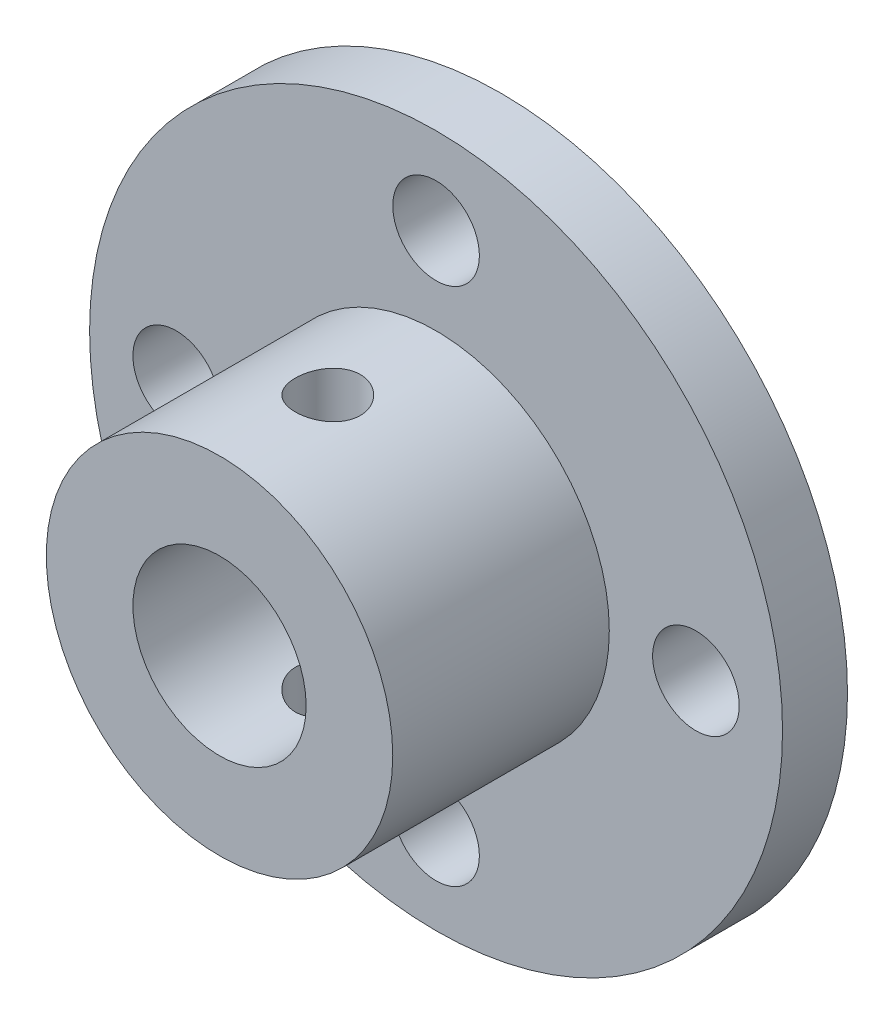
ISO-10303-21;
HEADER;
FILE_DESCRIPTION(('STEP AP214'),'2;1');
FILE_NAME('part.step','',(''),(''),'','','');
FILE_SCHEMA(('AUTOMOTIVE_DESIGN { 1 0 10303 214 1 1 1 1 }'));
ENDSEC;
DATA;
#1=APPLICATION_CONTEXT('core data for automotive mechanical design processes');
#2=APPLICATION_PROTOCOL_DEFINITION('international standard','automotive_design',2000,#1);
#3=PRODUCT_CONTEXT('',#1,'mechanical');
#4=PRODUCT('Part','Part','',(#3));
#5=PRODUCT_RELATED_PRODUCT_CATEGORY('part','',(#4));
#6=PRODUCT_DEFINITION_FORMATION('','',#4);
#7=PRODUCT_DEFINITION_CONTEXT('part definition',#1,'design');
#8=PRODUCT_DEFINITION('design','',#6,#7);
#9=PRODUCT_DEFINITION_SHAPE('','',#8);
#10=(LENGTH_UNIT() NAMED_UNIT(*) SI_UNIT(.MILLI.,.METRE.));
#11=(NAMED_UNIT(*) PLANE_ANGLE_UNIT() SI_UNIT($,.RADIAN.));
#12=(NAMED_UNIT(*) SI_UNIT($,.STERADIAN.) SOLID_ANGLE_UNIT());
#13=UNCERTAINTY_MEASURE_WITH_UNIT(LENGTH_MEASURE(1.E-05),#10,'distance_accuracy_value','');
#14=(GEOMETRIC_REPRESENTATION_CONTEXT(3) GLOBAL_UNCERTAINTY_ASSIGNED_CONTEXT((#13)) GLOBAL_UNIT_ASSIGNED_CONTEXT((#10,
#11,#12)) REPRESENTATION_CONTEXT('',''));
#15=CARTESIAN_POINT('',(0.,0.,0.));
#16=DIRECTION('',(0.,0.,1.));
#17=DIRECTION('',(1.,0.,0.));
#18=AXIS2_PLACEMENT_3D('',#15,#16,#17);
#19=CARTESIAN_POINT('',(0.,0.,3.));
#20=DIRECTION('',(0.,0.,-1.));
#21=DIRECTION('',(-1.,0.,0.));
#22=AXIS2_PLACEMENT_3D('',#19,#20,#21);
#23=CYLINDRICAL_SURFACE('',#22,16.);
#24=CARTESIAN_POINT('',(0.,0.,3.));
#25=DIRECTION('',(0.,0.,1.));
#26=DIRECTION('',(1.,0.,0.));
#27=AXIS2_PLACEMENT_3D('',#24,#25,#26);
#28=CIRCLE('',#27,16.);
#29=CARTESIAN_POINT('',(16.,0.,3.));
#30=VERTEX_POINT('',#29);
#31=EDGE_CURVE('E43',#30,#30,#28,.T.);
#32=ORIENTED_EDGE('',*,*,#31,.F.);
#33=EDGE_LOOP('',(#32));
#34=FACE_BOUND('',#33,.T.);
#35=CARTESIAN_POINT('',(0.,0.,0.));
#36=DIRECTION('',(0.,0.,1.));
#37=DIRECTION('',(1.,0.,0.));
#38=AXIS2_PLACEMENT_3D('',#35,#36,#37);
#39=CIRCLE('',#38,16.);
#40=CARTESIAN_POINT('',(16.,0.,0.));
#41=VERTEX_POINT('',#40);
#42=EDGE_CURVE('E48',#41,#41,#39,.T.);
#43=ORIENTED_EDGE('',*,*,#42,.T.);
#44=EDGE_LOOP('',(#43));
#45=FACE_BOUND('',#44,.T.);
#46=ADVANCED_FACE('F31',(#34,#45),#23,.T.);
#47=CARTESIAN_POINT('',(0.,0.,3.));
#48=DIRECTION('',(0.,0.,1.));
#49=DIRECTION('',(1.,0.,0.));
#50=AXIS2_PLACEMENT_3D('',#47,#48,#49);
#51=PLANE('',#50);
#52=CARTESIAN_POINT('',(12.,0.,3.));
#53=DIRECTION('',(0.,0.,1.));
#54=DIRECTION('',(1.,0.,0.));
#55=AXIS2_PLACEMENT_3D('',#52,#53,#54);
#56=CIRCLE('',#55,2.);
#57=CARTESIAN_POINT('',(14.,0.,3.));
#58=VERTEX_POINT('',#57);
#59=EDGE_CURVE('E211',#58,#58,#56,.T.);
#60=ORIENTED_EDGE('',*,*,#59,.F.);
#61=EDGE_LOOP('',(#60));
#62=FACE_BOUND('',#61,.T.);
#63=CARTESIAN_POINT('',(0.,12.,3.));
#64=DIRECTION('',(0.,0.,1.));
#65=DIRECTION('',(1.,0.,0.));
#66=AXIS2_PLACEMENT_3D('',#63,#64,#65);
#67=CIRCLE('',#66,2.);
#68=CARTESIAN_POINT('',(2.,12.,3.));
#69=VERTEX_POINT('',#68);
#70=EDGE_CURVE('E213',#69,#69,#67,.T.);
#71=ORIENTED_EDGE('',*,*,#70,.F.);
#72=EDGE_LOOP('',(#71));
#73=FACE_BOUND('',#72,.T.);
#74=CARTESIAN_POINT('',(-12.,0.,3.));
#75=DIRECTION('',(0.,0.,1.));
#76=DIRECTION('',(1.,0.,0.));
#77=AXIS2_PLACEMENT_3D('',#74,#75,#76);
#78=CIRCLE('',#77,2.);
#79=CARTESIAN_POINT('',(-10.,0.,3.));
#80=VERTEX_POINT('',#79);
#81=EDGE_CURVE('E216',#80,#80,#78,.T.);
#82=ORIENTED_EDGE('',*,*,#81,.F.);
#83=EDGE_LOOP('',(#82));
#84=FACE_BOUND('',#83,.T.);
#85=CARTESIAN_POINT('',(0.,-12.,3.));
#86=DIRECTION('',(0.,0.,1.));
#87=DIRECTION('',(1.,0.,0.));
#88=AXIS2_PLACEMENT_3D('',#85,#86,#87);
#89=CIRCLE('',#88,2.);
#90=CARTESIAN_POINT('',(2.,-12.,3.));
#91=VERTEX_POINT('',#90);
#92=EDGE_CURVE('E58',#91,#91,#89,.T.);
#93=ORIENTED_EDGE('',*,*,#92,.F.);
#94=EDGE_LOOP('',(#93));
#95=FACE_BOUND('',#94,.T.);
#96=CARTESIAN_POINT('',(0.,0.,3.));
#97=DIRECTION('',(0.,0.,1.));
#98=DIRECTION('',(1.,0.,0.));
#99=AXIS2_PLACEMENT_3D('',#96,#97,#98);
#100=CIRCLE('',#99,8.);
#101=CARTESIAN_POINT('',(8.,0.,3.));
#102=VERTEX_POINT('',#101);
#103=EDGE_CURVE('E10',#102,#102,#100,.T.);
#104=ORIENTED_EDGE('',*,*,#103,.F.);
#105=EDGE_LOOP('',(#104));
#106=FACE_BOUND('',#105,.T.);
#107=ORIENTED_EDGE('',*,*,#31,.T.);
#108=EDGE_LOOP('',(#107));
#109=FACE_BOUND('',#108,.T.);
#110=ADVANCED_FACE('F100',(#62,#73,#84,#95,#106,#109),#51,.T.);
#111=CARTESIAN_POINT('',(0.,0.,0.));
#112=DIRECTION('',(0.,0.,1.));
#113=DIRECTION('',(1.,0.,0.));
#114=AXIS2_PLACEMENT_3D('',#111,#112,#113);
#115=PLANE('',#114);
#116=CARTESIAN_POINT('',(12.,0.,0.));
#117=DIRECTION('',(0.,0.,1.));
#118=DIRECTION('',(1.,0.,0.));
#119=AXIS2_PLACEMENT_3D('',#116,#117,#118);
#120=CIRCLE('',#119,2.);
#121=CARTESIAN_POINT('',(14.,0.,0.));
#122=VERTEX_POINT('',#121);
#123=EDGE_CURVE('E225',#122,#122,#120,.T.);
#124=ORIENTED_EDGE('',*,*,#123,.T.);
#125=EDGE_LOOP('',(#124));
#126=FACE_BOUND('',#125,.T.);
#127=CARTESIAN_POINT('',(0.,12.,0.));
#128=DIRECTION('',(0.,0.,1.));
#129=DIRECTION('',(1.,0.,0.));
#130=AXIS2_PLACEMENT_3D('',#127,#128,#129);
#131=CIRCLE('',#130,2.);
#132=CARTESIAN_POINT('',(2.,12.,0.));
#133=VERTEX_POINT('',#132);
#134=EDGE_CURVE('E226',#133,#133,#131,.T.);
#135=ORIENTED_EDGE('',*,*,#134,.T.);
#136=EDGE_LOOP('',(#135));
#137=FACE_BOUND('',#136,.T.);
#138=CARTESIAN_POINT('',(-12.,0.,0.));
#139=DIRECTION('',(0.,0.,1.));
#140=DIRECTION('',(1.,0.,0.));
#141=AXIS2_PLACEMENT_3D('',#138,#139,#140);
#142=CIRCLE('',#141,2.);
#143=CARTESIAN_POINT('',(-10.,0.,0.));
#144=VERTEX_POINT('',#143);
#145=EDGE_CURVE('E229',#144,#144,#142,.T.);
#146=ORIENTED_EDGE('',*,*,#145,.T.);
#147=EDGE_LOOP('',(#146));
#148=FACE_BOUND('',#147,.T.);
#149=CARTESIAN_POINT('',(0.,-12.,0.));
#150=DIRECTION('',(0.,0.,1.));
#151=DIRECTION('',(1.,0.,0.));
#152=AXIS2_PLACEMENT_3D('',#149,#150,#151);
#153=CIRCLE('',#152,2.);
#154=CARTESIAN_POINT('',(2.,-12.,0.));
#155=VERTEX_POINT('',#154);
#156=EDGE_CURVE('E231',#155,#155,#153,.T.);
#157=ORIENTED_EDGE('',*,*,#156,.T.);
#158=EDGE_LOOP('',(#157));
#159=FACE_BOUND('',#158,.T.);
#160=CARTESIAN_POINT('',(0.,0.,0.));
#161=DIRECTION('',(0.,0.,1.));
#162=DIRECTION('',(1.,0.,0.));
#163=AXIS2_PLACEMENT_3D('',#160,#161,#162);
#164=CIRCLE('',#163,4.);
#165=CARTESIAN_POINT('',(4.,0.,0.));
#166=VERTEX_POINT('',#165);
#167=EDGE_CURVE('E59',#166,#166,#164,.T.);
#168=ORIENTED_EDGE('',*,*,#167,.T.);
#169=EDGE_LOOP('',(#168));
#170=FACE_BOUND('',#169,.T.);
#171=ORIENTED_EDGE('',*,*,#42,.F.);
#172=EDGE_LOOP('',(#171));
#173=FACE_BOUND('',#172,.T.);
#174=ADVANCED_FACE('F98',(#126,#137,#148,#159,#170,#173),#115,.F.);
#175=CARTESIAN_POINT('',(0.,0.,13.));
#176=DIRECTION('',(0.,0.,-1.));
#177=DIRECTION('',(-1.,0.,0.));
#178=AXIS2_PLACEMENT_3D('',#175,#176,#177);
#179=CYLINDRICAL_SURFACE('',#178,8.);
#180=CARTESIAN_POINT('',(0.,-8.,9.5));
#181=CARTESIAN_POINT('',(0.0834717464654709,-7.99999848833852,9.49999681041172));
#182=CARTESIAN_POINT('',(0.166984992730099,-7.99868009921714,9.49300892338062));
#183=CARTESIAN_POINT('',(0.331658129841797,-7.9935478589052,9.46526000488165));
#184=CARTESIAN_POINT('',(0.412815974152225,-7.98973190166897,9.44448734936027));
#185=CARTESIAN_POINT('',(0.570372961851801,-7.98003138765458,9.38982729874066));
#186=CARTESIAN_POINT('',(0.646776330685344,-7.97414869946483,9.35595174754746));
#187=CARTESIAN_POINT('',(0.792807973094007,-7.96095710599783,9.27608112307718));
#188=CARTESIAN_POINT('',(0.862436794477323,-7.9536483161829,9.23008703085518));
#189=CARTESIAN_POINT('',(0.993783715930502,-7.93831336430504,9.12670023199632));
#190=CARTESIAN_POINT('',(1.05540895503183,-7.93028034856351,9.06919055532986));
#191=CARTESIAN_POINT('',(1.16819606135369,-7.9144531845865,8.94465669091244));
#192=CARTESIAN_POINT('',(1.21935717689241,-7.90665905354527,8.87763182023071));
#193=CARTESIAN_POINT('',(1.31014998665793,-7.89212551245005,8.73531391163603));
#194=CARTESIAN_POINT('',(1.34968721969605,-7.88539493886182,8.65995962968276));
#195=CARTESIAN_POINT('',(1.41550524332283,-7.87384713211987,8.50353108482321));
#196=CARTESIAN_POINT('',(1.44178717713098,-7.86902973396962,8.42245731588878));
#197=CARTESIAN_POINT('',(1.480050535035,-7.8619226957455,8.25788476908559));
#198=CARTESIAN_POINT('',(1.49219390192039,-7.85960445366405,8.17442490279654));
#199=CARTESIAN_POINT('',(1.50233808095346,-7.85767197152761,8.00662261519175));
#200=CARTESIAN_POINT('',(1.50034016135374,-7.8580574889876,7.9222802736977));
#201=CARTESIAN_POINT('',(1.48238979602362,-7.86146292701753,7.75628047473396));
#202=CARTESIAN_POINT('',(1.46662149996045,-7.86444808147334,7.67460228569985));
#203=CARTESIAN_POINT('',(1.42186799396207,-7.87266183284666,7.51507158021739));
#204=CARTESIAN_POINT('',(1.39288222239499,-7.87789052509516,7.4372192264907));
#205=CARTESIAN_POINT('',(1.322336471793,-7.89003855292588,7.28701132099974));
#206=CARTESIAN_POINT('',(1.28070213532456,-7.89696783823366,7.21469152941919));
#207=CARTESIAN_POINT('',(1.18609368930416,-7.91172971602918,7.07799527145977));
#208=CARTESIAN_POINT('',(1.13311842889266,-7.91956240015522,7.0136196122852));
#209=CARTESIAN_POINT('',(1.01633905685298,-7.93540001272164,6.89357504432754));
#210=CARTESIAN_POINT('',(0.952377436860683,-7.9434057102403,6.83805934754826));
#211=CARTESIAN_POINT('',(0.815968037098827,-7.95857386108318,6.73852275932459));
#212=CARTESIAN_POINT('',(0.74352017225577,-7.96573630595245,6.69450198312958));
#213=CARTESIAN_POINT('',(0.592034988874669,-7.97842539677509,6.61918224612998));
#214=CARTESIAN_POINT('',(0.512989564446494,-7.98394999136289,6.58789922088211));
#215=CARTESIAN_POINT('',(0.350639115398697,-7.99272505402719,6.53909790690784));
#216=CARTESIAN_POINT('',(0.267334544277787,-7.99597576367994,6.52157815595464));
#217=CARTESIAN_POINT('',(0.100148652903386,-7.99980360641981,6.50101396898173));
#218=CARTESIAN_POINT('',(0.0162940126341359,-8.00041950912279,6.49775960847027));
#219=CARTESIAN_POINT('',(-0.150761248092183,-7.99901543598228,6.50525547954765));
#220=CARTESIAN_POINT('',(-0.233961900480385,-7.99699558964431,6.51600502306526));
#221=CARTESIAN_POINT('',(-0.396681573218217,-7.99057111500406,6.55102903518337));
#222=CARTESIAN_POINT('',(-0.476224261046063,-7.98618522374031,6.57519728253781));
#223=CARTESIAN_POINT('',(-0.630128631824633,-7.97551842212498,6.63625770677879));
#224=CARTESIAN_POINT('',(-0.704489962595103,-7.96923738311334,6.67315074756578));
#225=CARTESIAN_POINT('',(-0.846816671513214,-7.95538030357666,6.75907812815951));
#226=CARTESIAN_POINT('',(-0.914703277015121,-7.94779086174563,6.80824073853684));
#227=CARTESIAN_POINT('',(-1.04133832326455,-7.93219343489712,6.91713813736236));
#228=CARTESIAN_POINT('',(-1.10008590976087,-7.92418541084687,6.97687391300133));
#229=CARTESIAN_POINT('',(-1.20757295872048,-7.9085247569745,7.10617231891143));
#230=CARTESIAN_POINT('',(-1.25616916218577,-7.90087825860257,7.17585490812539));
#231=CARTESIAN_POINT('',(-1.34096675057787,-7.88692985578532,7.32251762452375));
#232=CARTESIAN_POINT('',(-1.37716859613924,-7.8806279013735,7.39949748037047));
#233=CARTESIAN_POINT('',(-1.43594673512823,-7.87013024209574,7.55820586724254));
#234=CARTESIAN_POINT('',(-1.45858868794786,-7.86592440436878,7.63990937955933));
#235=CARTESIAN_POINT('',(-1.48980679326235,-7.86007203802415,7.8060472225214));
#236=CARTESIAN_POINT('',(-1.49838453270708,-7.8584252206579,7.8904812439704));
#237=CARTESIAN_POINT('',(-1.50117762148355,-7.85789199803857,8.05824833144151));
#238=CARTESIAN_POINT('',(-1.49561895003499,-7.85896215974293,8.14157758095699));
#239=CARTESIAN_POINT('',(-1.47079175378803,-7.86364600659998,8.30609142204529));
#240=CARTESIAN_POINT('',(-1.45152331089332,-7.86725967655747,8.38727602642744));
#241=CARTESIAN_POINT('',(-1.39991887583263,-7.8766050802318,8.54507448479548));
#242=CARTESIAN_POINT('',(-1.36760735397252,-7.88233284594965,8.62169659134577));
#243=CARTESIAN_POINT('',(-1.29085868912204,-7.8952638755184,8.76846825424084));
#244=CARTESIAN_POINT('',(-1.24642068948186,-7.90246724360119,8.83861735284478));
#245=CARTESIAN_POINT('',(-1.14589487339535,-7.91767266107745,8.97158368004229));
#246=CARTESIAN_POINT('',(-1.08964259864303,-7.92568505353043,9.0342754125671));
#247=CARTESIAN_POINT('',(-0.96742792674229,-7.94152833918735,9.14940516246452));
#248=CARTESIAN_POINT('',(-0.901463301891616,-7.94935919027328,9.20184082098014));
#249=CARTESIAN_POINT('',(-0.760984945071872,-7.96403975968049,9.29541095262706));
#250=CARTESIAN_POINT('',(-0.686399590640516,-7.97088000990561,9.33643942849064));
#251=CARTESIAN_POINT('',(-0.531290113653833,-7.98271619380687,9.40531763660514));
#252=CARTESIAN_POINT('',(-0.450771651705247,-7.98771385879037,9.43317974704691));
#253=CARTESIAN_POINT('',(-0.308347202825154,-7.99428290707632,9.46927731441867));
#254=CARTESIAN_POINT('',(-0.24727381025187,-7.99641470878206,9.4807786303128));
#255=CARTESIAN_POINT('',(-0.124141247115158,-7.9992737995401,9.49614106211645));
#256=CARTESIAN_POINT('',(-0.0620821016527095,-8.00000112429805,9.50000237225591));
#257=CARTESIAN_POINT('',(0.,-8.,9.5));
#258=B_SPLINE_CURVE_WITH_KNOTS('',3,(#180,#181,#182,#183,#184,#185,#186,#187,#188,#189,#190,
#191,#192,#193,#194,#195,#196,#197,#198,#199,#200,#201,#202,#203,#204,#205,#206,#207,#208,#209,
#210,#211,#212,#213,#214,#215,#216,#217,#218,#219,#220,#221,#222,#223,#224,#225,#226,#227,#228,
#229,#230,#231,#232,#233,#234,#235,#236,#237,#238,#239,#240,#241,#242,#243,#244,#245,#246,#247,
#248,#249,#250,#251,#252,#253,#254,#255,#256,#257),.UNSPECIFIED.,.T.,.F.,(4,2,2,2,2,2,2,2,2,2,2,
2,2,2,2,2,2,2,2,2,2,2,2,2,2,2,2,2,2,2,2,2,2,2,2,2,2,2,4),(0.,0.250188200964924,
0.500587642535452,0.750761271230907,1.00091465336891,1.2537511801363,1.50660586283617,
1.76146190504357,2.01629596311948,2.26818151445336,2.52004447587256,2.76859000612765,
3.01714609846786,3.2671926262953,3.51726454049859,3.77127768464077,4.02529337544948,
4.27962588321699,4.53393136673745,4.78448174076097,5.03501980464583,5.28360233907828,
5.53220175338032,5.78351778017708,6.03485728413098,6.28953436987299,6.54420198954945,
6.79762627818559,7.05102196946512,7.30039252231748,7.54976158541506,7.79866496207692,
8.04758592655423,8.3002336996638,8.55293951262255,8.80792048916315,9.06266126931173,
9.24874344524409,9.43482089039541),.UNSPECIFIED.);
#259=CARTESIAN_POINT('',(0.,-8.,9.5));
#260=VERTEX_POINT('',#259);
#261=EDGE_CURVE('E88',#260,#260,#258,.T.);
#262=ORIENTED_EDGE('',*,*,#261,.T.);
#263=EDGE_LOOP('',(#262));
#264=FACE_BOUND('',#263,.T.);
#265=CARTESIAN_POINT('',(0.,8.,9.5));
#266=CARTESIAN_POINT('',(-0.0834717464654709,7.99999848833852,9.49999681041172));
#267=CARTESIAN_POINT('',(-0.166984992730099,7.99868009921714,9.49300892338062));
#268=CARTESIAN_POINT('',(-0.331658129841797,7.9935478589052,9.46526000488165));
#269=CARTESIAN_POINT('',(-0.412815974152225,7.98973190166897,9.44448734936027));
#270=CARTESIAN_POINT('',(-0.570372961851801,7.98003138765458,9.38982729874066));
#271=CARTESIAN_POINT('',(-0.646776330685344,7.97414869946483,9.35595174754746));
#272=CARTESIAN_POINT('',(-0.792807973094007,7.96095710599783,9.27608112307718));
#273=CARTESIAN_POINT('',(-0.862436794477323,7.9536483161829,9.23008703085518));
#274=CARTESIAN_POINT('',(-0.993783715930502,7.93831336430504,9.12670023199632));
#275=CARTESIAN_POINT('',(-1.05540895503183,7.93028034856351,9.06919055532986));
#276=CARTESIAN_POINT('',(-1.16819606135369,7.9144531845865,8.94465669091244));
#277=CARTESIAN_POINT('',(-1.21935717689241,7.90665905354527,8.87763182023071));
#278=CARTESIAN_POINT('',(-1.31014998665793,7.89212551245005,8.73531391163603));
#279=CARTESIAN_POINT('',(-1.34968721969605,7.88539493886182,8.65995962968276));
#280=CARTESIAN_POINT('',(-1.41550524332283,7.87384713211987,8.50353108482321));
#281=CARTESIAN_POINT('',(-1.44178717713098,7.86902973396962,8.42245731588878));
#282=CARTESIAN_POINT('',(-1.480050535035,7.8619226957455,8.25788476908559));
#283=CARTESIAN_POINT('',(-1.49219390192039,7.85960445366405,8.17442490279654));
#284=CARTESIAN_POINT('',(-1.50233808095346,7.85767197152761,8.00662261519175));
#285=CARTESIAN_POINT('',(-1.50034016135374,7.8580574889876,7.9222802736977));
#286=CARTESIAN_POINT('',(-1.48238979602362,7.86146292701753,7.75628047473396));
#287=CARTESIAN_POINT('',(-1.46662149996045,7.86444808147334,7.67460228569985));
#288=CARTESIAN_POINT('',(-1.42186799396207,7.87266183284666,7.51507158021739));
#289=CARTESIAN_POINT('',(-1.39288222239499,7.87789052509516,7.4372192264907));
#290=CARTESIAN_POINT('',(-1.322336471793,7.89003855292588,7.28701132099974));
#291=CARTESIAN_POINT('',(-1.28070213532456,7.89696783823366,7.21469152941919));
#292=CARTESIAN_POINT('',(-1.18609368930416,7.91172971602918,7.07799527145977));
#293=CARTESIAN_POINT('',(-1.13311842889266,7.91956240015522,7.0136196122852));
#294=CARTESIAN_POINT('',(-1.01633905685298,7.93540001272164,6.89357504432754));
#295=CARTESIAN_POINT('',(-0.952377436860683,7.9434057102403,6.83805934754826));
#296=CARTESIAN_POINT('',(-0.815968037098827,7.95857386108318,6.73852275932459));
#297=CARTESIAN_POINT('',(-0.74352017225577,7.96573630595245,6.69450198312958));
#298=CARTESIAN_POINT('',(-0.592034988874669,7.97842539677509,6.61918224612998));
#299=CARTESIAN_POINT('',(-0.512989564446494,7.98394999136289,6.58789922088211));
#300=CARTESIAN_POINT('',(-0.350639115398697,7.99272505402719,6.53909790690784));
#301=CARTESIAN_POINT('',(-0.267334544277787,7.99597576367994,6.52157815595464));
#302=CARTESIAN_POINT('',(-0.100148652903386,7.99980360641981,6.50101396898173));
#303=CARTESIAN_POINT('',(-0.0162940126341359,8.00041950912279,6.49775960847027));
#304=CARTESIAN_POINT('',(0.150761248092183,7.99901543598228,6.50525547954765));
#305=CARTESIAN_POINT('',(0.233961900480385,7.99699558964431,6.51600502306526));
#306=CARTESIAN_POINT('',(0.396681573218217,7.99057111500406,6.55102903518337));
#307=CARTESIAN_POINT('',(0.476224261046063,7.98618522374031,6.57519728253781));
#308=CARTESIAN_POINT('',(0.630128631824633,7.97551842212498,6.63625770677879));
#309=CARTESIAN_POINT('',(0.704489962595103,7.96923738311334,6.67315074756578));
#310=CARTESIAN_POINT('',(0.846816671513214,7.95538030357666,6.75907812815951));
#311=CARTESIAN_POINT('',(0.914703277015121,7.94779086174563,6.80824073853684));
#312=CARTESIAN_POINT('',(1.04133832326455,7.93219343489712,6.91713813736236));
#313=CARTESIAN_POINT('',(1.10008590976087,7.92418541084687,6.97687391300133));
#314=CARTESIAN_POINT('',(1.20757295872048,7.9085247569745,7.10617231891143));
#315=CARTESIAN_POINT('',(1.25616916218577,7.90087825860257,7.17585490812539));
#316=CARTESIAN_POINT('',(1.34096675057787,7.88692985578532,7.32251762452375));
#317=CARTESIAN_POINT('',(1.37716859613924,7.8806279013735,7.39949748037047));
#318=CARTESIAN_POINT('',(1.43594673512823,7.87013024209574,7.55820586724254));
#319=CARTESIAN_POINT('',(1.45858868794786,7.86592440436878,7.63990937955933));
#320=CARTESIAN_POINT('',(1.48980679326235,7.86007203802415,7.8060472225214));
#321=CARTESIAN_POINT('',(1.49838453270708,7.8584252206579,7.8904812439704));
#322=CARTESIAN_POINT('',(1.50117762148355,7.85789199803857,8.05824833144151));
#323=CARTESIAN_POINT('',(1.49561895003499,7.85896215974293,8.14157758095699));
#324=CARTESIAN_POINT('',(1.47079175378803,7.86364600659998,8.30609142204529));
#325=CARTESIAN_POINT('',(1.45152331089332,7.86725967655747,8.38727602642744));
#326=CARTESIAN_POINT('',(1.39991887583263,7.8766050802318,8.54507448479548));
#327=CARTESIAN_POINT('',(1.36760735397252,7.88233284594965,8.62169659134577));
#328=CARTESIAN_POINT('',(1.29085868912204,7.8952638755184,8.76846825424084));
#329=CARTESIAN_POINT('',(1.24642068948186,7.90246724360119,8.83861735284478));
#330=CARTESIAN_POINT('',(1.14589487339535,7.91767266107745,8.97158368004229));
#331=CARTESIAN_POINT('',(1.08964259864303,7.92568505353043,9.0342754125671));
#332=CARTESIAN_POINT('',(0.96742792674229,7.94152833918735,9.14940516246452));
#333=CARTESIAN_POINT('',(0.901463301891616,7.94935919027328,9.20184082098014));
#334=CARTESIAN_POINT('',(0.760984945071872,7.96403975968049,9.29541095262706));
#335=CARTESIAN_POINT('',(0.686399590640516,7.97088000990561,9.33643942849064));
#336=CARTESIAN_POINT('',(0.531290113653833,7.98271619380687,9.40531763660514));
#337=CARTESIAN_POINT('',(0.450771651705247,7.98771385879037,9.43317974704691));
#338=CARTESIAN_POINT('',(0.308347202825154,7.99428290707632,9.46927731441867));
#339=CARTESIAN_POINT('',(0.24727381025187,7.99641470878206,9.4807786303128));
#340=CARTESIAN_POINT('',(0.124141247115158,7.9992737995401,9.49614106211645));
#341=CARTESIAN_POINT('',(0.0620821016527095,8.00000112429805,9.50000237225591));
#342=CARTESIAN_POINT('',(0.,8.,9.5));
#343=B_SPLINE_CURVE_WITH_KNOTS('',3,(#265,#266,#267,#268,#269,#270,#271,#272,#273,#274,#275,
#276,#277,#278,#279,#280,#281,#282,#283,#284,#285,#286,#287,#288,#289,#290,#291,#292,#293,#294,
#295,#296,#297,#298,#299,#300,#301,#302,#303,#304,#305,#306,#307,#308,#309,#310,#311,#312,#313,
#314,#315,#316,#317,#318,#319,#320,#321,#322,#323,#324,#325,#326,#327,#328,#329,#330,#331,#332,
#333,#334,#335,#336,#337,#338,#339,#340,#341,#342),.UNSPECIFIED.,.T.,.F.,(4,2,2,2,2,2,2,2,2,2,2,
2,2,2,2,2,2,2,2,2,2,2,2,2,2,2,2,2,2,2,2,2,2,2,2,2,2,2,4),(0.,0.250188200964924,
0.500587642535452,0.750761271230907,1.00091465336891,1.2537511801363,1.50660586283617,
1.76146190504357,2.01629596311948,2.26818151445336,2.52004447587256,2.76859000612765,
3.01714609846786,3.2671926262953,3.51726454049859,3.77127768464077,4.02529337544948,
4.27962588321699,4.53393136673745,4.78448174076097,5.03501980464583,5.28360233907828,
5.53220175338032,5.78351778017708,6.03485728413098,6.28953436987299,6.54420198954945,
6.79762627818559,7.05102196946512,7.30039252231748,7.54976158541506,7.79866496207692,
8.04758592655423,8.3002336996638,8.55293951262255,8.80792048916315,9.06266126931173,
9.24874344524409,9.43482089039541),.UNSPECIFIED.);
#344=CARTESIAN_POINT('',(0.,8.,9.5));
#345=VERTEX_POINT('',#344);
#346=EDGE_CURVE('E82',#345,#345,#343,.T.);
#347=ORIENTED_EDGE('',*,*,#346,.T.);
#348=EDGE_LOOP('',(#347));
#349=FACE_BOUND('',#348,.T.);
#350=CARTESIAN_POINT('',(0.,0.,13.));
#351=DIRECTION('',(0.,0.,1.));
#352=DIRECTION('',(1.,0.,0.));
#353=AXIS2_PLACEMENT_3D('',#350,#351,#352);
#354=CIRCLE('',#353,8.);
#355=CARTESIAN_POINT('',(8.,0.,13.));
#356=VERTEX_POINT('',#355);
#357=EDGE_CURVE('E51',#356,#356,#354,.T.);
#358=ORIENTED_EDGE('',*,*,#357,.F.);
#359=EDGE_LOOP('',(#358));
#360=FACE_BOUND('',#359,.T.);
#361=ORIENTED_EDGE('',*,*,#103,.T.);
#362=EDGE_LOOP('',(#361));
#363=FACE_BOUND('',#362,.T.);
#364=ADVANCED_FACE('F93',(#264,#349,#360,#363),#179,.T.);
#365=CARTESIAN_POINT('',(0.,0.,13.));
#366=DIRECTION('',(0.,0.,1.));
#367=DIRECTION('',(1.,0.,0.));
#368=AXIS2_PLACEMENT_3D('',#365,#366,#367);
#369=PLANE('',#368);
#370=CARTESIAN_POINT('',(0.,0.,13.));
#371=DIRECTION('',(0.,0.,1.));
#372=DIRECTION('',(1.,0.,0.));
#373=AXIS2_PLACEMENT_3D('',#370,#371,#372);
#374=CIRCLE('',#373,4.);
#375=CARTESIAN_POINT('',(4.,0.,13.));
#376=VERTEX_POINT('',#375);
#377=EDGE_CURVE('E56',#376,#376,#374,.T.);
#378=ORIENTED_EDGE('',*,*,#377,.F.);
#379=EDGE_LOOP('',(#378));
#380=FACE_BOUND('',#379,.T.);
#381=ORIENTED_EDGE('',*,*,#357,.T.);
#382=EDGE_LOOP('',(#381));
#383=FACE_BOUND('',#382,.T.);
#384=ADVANCED_FACE('F97',(#380,#383),#369,.T.);
#385=CARTESIAN_POINT('',(0.,0.,0.));
#386=DIRECTION('',(0.,0.,1.));
#387=DIRECTION('',(1.,0.,0.));
#388=AXIS2_PLACEMENT_3D('',#385,#386,#387);
#389=CYLINDRICAL_SURFACE('',#388,4.);
#390=CARTESIAN_POINT('',(0.,-4.,9.5));
#391=CARTESIAN_POINT('',(-0.0812350589378527,-4.00000217456151,9.50000290230311));
#392=CARTESIAN_POINT('',(-0.162450241781792,-3.99750379283184,9.49338023975162));
#393=CARTESIAN_POINT('',(-0.322453452352361,-3.98778696006928,9.46717180473007));
#394=CARTESIAN_POINT('',(-0.401241827987616,-3.98056918893993,9.44758789952943));
#395=CARTESIAN_POINT('',(-0.554060784990878,-3.96218832391545,9.39624699822824));
#396=CARTESIAN_POINT('',(-0.628100224162277,-3.9510328434944,9.36451348317821));
#397=CARTESIAN_POINT('',(-0.769799310160253,-3.92588767765353,9.28989358698418));
#398=CARTESIAN_POINT('',(-0.837457239177879,-3.91189723227548,9.24700421445585));
#399=CARTESIAN_POINT('',(-0.967346417045825,-3.88186246971217,9.14938746892909));
#400=CARTESIAN_POINT('',(-1.02927073015119,-3.86576002583566,9.0942697377406));
#401=CARTESIAN_POINT('',(-1.14324421474363,-3.83360220871327,8.97458956534116));
#402=CARTESIAN_POINT('',(-1.19529036359203,-3.81754685135033,8.91002424391213));
#403=CARTESIAN_POINT('',(-1.28998202215985,-3.78662470617731,8.77028253247679));
#404=CARTESIAN_POINT('',(-1.3321939319576,-3.77182648820818,8.69479563345418));
#405=CARTESIAN_POINT('',(-1.40318646334084,-3.74599860237433,8.53715164583148));
#406=CARTESIAN_POINT('',(-1.43197244961239,-3.73496742975881,8.4549972368449));
#407=CARTESIAN_POINT('',(-1.47408431017549,-3.71854412824136,8.2898832597418));
#408=CARTESIAN_POINT('',(-1.48799593218558,-3.71293924350838,8.20709496156456));
#409=CARTESIAN_POINT('',(-1.50179556531648,-3.70738061461215,8.04018384200616));
#410=CARTESIAN_POINT('',(-1.50168936802631,-3.70742453659305,7.95606158612553));
#411=CARTESIAN_POINT('',(-1.48790429610018,-3.71297511632055,7.79423047478705));
#412=CARTESIAN_POINT('',(-1.47503808509004,-3.71815468871122,7.71643909395582));
#413=CARTESIAN_POINT('',(-1.4374416786833,-3.73284938059529,7.56421284959468));
#414=CARTESIAN_POINT('',(-1.41270969663258,-3.74236515298863,7.48977849338612));
#415=CARTESIAN_POINT('',(-1.35163748571904,-3.76485702190253,7.34472293227177));
#416=CARTESIAN_POINT('',(-1.31508648737101,-3.77789517988166,7.2742005138787));
#417=CARTESIAN_POINT('',(-1.23156073762698,-3.80594210139319,7.14005426240903));
#418=CARTESIAN_POINT('',(-1.18458238728897,-3.82095154457158,7.0764328224803));
#419=CARTESIAN_POINT('',(-1.07781780766549,-3.85248038859113,6.95339633634912));
#420=CARTESIAN_POINT('',(-1.01738298716956,-3.86903347455671,6.89455135925191));
#421=CARTESIAN_POINT('',(-0.887312590819021,-3.90091728164085,6.7876620337942));
#422=CARTESIAN_POINT('',(-0.817675603497364,-3.91624781465952,6.73961934539433));
#423=CARTESIAN_POINT('',(-0.66972343699242,-3.9442639480908,6.65506960293748));
#424=CARTESIAN_POINT('',(-0.59129071384472,-3.95690498259616,6.61875241877894));
#425=CARTESIAN_POINT('',(-0.428836850524584,-3.97778718326962,6.56001739572996));
#426=CARTESIAN_POINT('',(-0.344818210845768,-3.98603030341493,6.53759338343888));
#427=CARTESIAN_POINT('',(-0.178375243148666,-3.99684443228065,6.50837721245806));
#428=CARTESIAN_POINT('',(-0.0961036195622098,-3.99969369025686,6.50081739361749));
#429=CARTESIAN_POINT('',(0.0685724752550238,-4.00025893700126,6.49930893610008));
#430=CARTESIAN_POINT('',(0.150976912983372,-3.99797606386863,6.50535727968322));
#431=CARTESIAN_POINT('',(0.310262048561859,-3.98871709772643,6.53031004230867));
#432=CARTESIAN_POINT('',(0.387233328007336,-3.98192470962305,6.54871154373709));
#433=CARTESIAN_POINT('',(0.536941754957221,-3.96451477091717,6.59718607254732));
#434=CARTESIAN_POINT('',(0.609678350347534,-3.9538967228203,6.62726061794803));
#435=CARTESIAN_POINT('',(0.751247765110155,-3.92949624407681,6.69918641243947));
#436=CARTESIAN_POINT('',(0.819903083557795,-3.91563000209348,6.74135772922338));
#437=CARTESIAN_POINT('',(0.949392711726625,-3.88626671564664,6.83591810317156));
#438=CARTESIAN_POINT('',(1.01022412027045,-3.87076907009516,6.88831093254515));
#439=CARTESIAN_POINT('',(1.12603079874454,-3.8387332949099,7.00540412212427));
#440=CARTESIAN_POINT('',(1.18046154123569,-3.82218696503729,7.0706421827727));
#441=CARTESIAN_POINT('',(1.27771050031903,-3.79078815746854,7.20965138470766));
#442=CARTESIAN_POINT('',(1.32052767414518,-3.77593583194399,7.2834232913885));
#443=CARTESIAN_POINT('',(1.39337773518998,-3.74966829822463,7.43801598677231));
#444=CARTESIAN_POINT('',(1.42335685446918,-3.73826760328493,7.51886474591044));
#445=CARTESIAN_POINT('',(1.46907883466889,-3.72054032891005,7.68500976368782));
#446=CARTESIAN_POINT('',(1.48483050305535,-3.71421061057491,7.77030323619812));
#447=CARTESIAN_POINT('',(1.50086347097839,-3.70775894792573,7.93701615954111));
#448=CARTESIAN_POINT('',(1.50207331495837,-3.70726444523341,8.01833263171689));
#449=CARTESIAN_POINT('',(1.49136715641593,-3.71158412745292,8.17994531627617));
#450=CARTESIAN_POINT('',(1.47945239850124,-3.71639780898899,8.26024162467158));
#451=CARTESIAN_POINT('',(1.44355815630242,-3.73048141585432,8.41504722671655));
#452=CARTESIAN_POINT('',(1.41995798316524,-3.73961085376663,8.48965834624535));
#453=CARTESIAN_POINT('',(1.3616969677992,-3.76121548297845,8.63390550849442));
#454=CARTESIAN_POINT('',(1.32703332944945,-3.77369151995215,8.70354028807014));
#455=CARTESIAN_POINT('',(1.24552075938154,-3.80139723903965,8.83982678969763));
#456=CARTESIAN_POINT('',(1.1981283280301,-3.81673698440964,8.90613079679991));
#457=CARTESIAN_POINT('',(1.09334485729906,-3.84806246757177,9.03014156097121));
#458=CARTESIAN_POINT('',(1.03595064012808,-3.86404840943145,9.08784557478675));
#459=CARTESIAN_POINT('',(0.909080396784624,-3.89590424609881,9.19620195582184));
#460=CARTESIAN_POINT('',(0.839118644212993,-3.91172104900645,9.24630375343467));
#461=CARTESIAN_POINT('',(0.691213223200822,-3.94054514457031,9.33402265527655));
#462=CARTESIAN_POINT('',(0.613268934090622,-3.95355221851559,9.37163878773637));
#463=CARTESIAN_POINT('',(0.447999082002313,-3.9757429260668,9.43437682904833));
#464=CARTESIAN_POINT('',(0.36041342223421,-3.98473657158356,9.4588870646019));
#465=CARTESIAN_POINT('',(0.181875733606383,-3.99686242179587,9.49169295992068));
#466=CARTESIAN_POINT('',(0.0909254163648595,-3.99999756603967,9.49999675148732));
#467=CARTESIAN_POINT('',(0.,-4.,9.5));
#468=B_SPLINE_CURVE_WITH_KNOTS('',3,(#390,#391,#392,#393,#394,#395,#396,#397,#398,#399,#400,
#401,#402,#403,#404,#405,#406,#407,#408,#409,#410,#411,#412,#413,#414,#415,#416,#417,#418,#419,
#420,#421,#422,#423,#424,#425,#426,#427,#428,#429,#430,#431,#432,#433,#434,#435,#436,#437,#438,
#439,#440,#441,#442,#443,#444,#445,#446,#447,#448,#449,#450,#451,#452,#453,#454,#455,#456,#457,
#458,#459,#460,#461,#462,#463,#464,#465,#466,#467),.UNSPECIFIED.,.T.,.F.,(4,2,2,2,2,2,2,2,2,2,2,
2,2,2,2,2,2,2,2,2,2,2,2,2,2,2,2,2,2,2,2,2,2,2,2,2,2,2,4),(0.,0.243369801560559,0.48670454953046,
0.729571369213572,0.972503379609489,1.22473618582715,1.47704604925622,1.73896674501658,
2.00078269352134,2.25185874416901,2.50283106079707,2.73878345119971,2.97477138060589,
3.21522408387018,3.45575990744258,3.71246153335813,3.96920257905066,4.22991375286075,
4.49050899698846,4.73725019635925,4.9839366839052,5.2211443792384,5.45838293254453,
5.70259221859599,5.94689180019868,6.20536519455658,6.46386178920141,6.72343066727204,
6.98283874956507,7.22558763480252,7.46831350211259,7.70363142426533,7.93900886656506,
8.18672471884271,8.43451941997062,8.69572329654039,8.95694749805102,9.22948515032042,
9.50188601796127),.UNSPECIFIED.);
#469=CARTESIAN_POINT('',(0.,-4.,9.5));
#470=VERTEX_POINT('',#469);
#471=EDGE_CURVE('E34',#470,#470,#468,.T.);
#472=ORIENTED_EDGE('',*,*,#471,.T.);
#473=EDGE_LOOP('',(#472));
#474=FACE_BOUND('',#473,.T.);
#475=CARTESIAN_POINT('',(0.,4.,9.5));
#476=CARTESIAN_POINT('',(0.0812350589378527,4.00000217456151,9.50000290230311));
#477=CARTESIAN_POINT('',(0.162450241781792,3.99750379283184,9.49338023975162));
#478=CARTESIAN_POINT('',(0.322453452352361,3.98778696006928,9.46717180473007));
#479=CARTESIAN_POINT('',(0.401241827987616,3.98056918893993,9.44758789952943));
#480=CARTESIAN_POINT('',(0.554060784990878,3.96218832391545,9.39624699822824));
#481=CARTESIAN_POINT('',(0.628100224162277,3.9510328434944,9.36451348317821));
#482=CARTESIAN_POINT('',(0.769799310160253,3.92588767765353,9.28989358698418));
#483=CARTESIAN_POINT('',(0.837457239177879,3.91189723227548,9.24700421445585));
#484=CARTESIAN_POINT('',(0.967346417045825,3.88186246971217,9.14938746892909));
#485=CARTESIAN_POINT('',(1.02927073015119,3.86576002583566,9.0942697377406));
#486=CARTESIAN_POINT('',(1.14324421474363,3.83360220871327,8.97458956534116));
#487=CARTESIAN_POINT('',(1.19529036359203,3.81754685135033,8.91002424391213));
#488=CARTESIAN_POINT('',(1.28998202215985,3.78662470617731,8.77028253247679));
#489=CARTESIAN_POINT('',(1.3321939319576,3.77182648820818,8.69479563345418));
#490=CARTESIAN_POINT('',(1.40318646334084,3.74599860237433,8.53715164583148));
#491=CARTESIAN_POINT('',(1.43197244961239,3.73496742975881,8.4549972368449));
#492=CARTESIAN_POINT('',(1.47408431017549,3.71854412824136,8.2898832597418));
#493=CARTESIAN_POINT('',(1.48799593218558,3.71293924350838,8.20709496156456));
#494=CARTESIAN_POINT('',(1.50179556531648,3.70738061461215,8.04018384200616));
#495=CARTESIAN_POINT('',(1.50168936802631,3.70742453659305,7.95606158612553));
#496=CARTESIAN_POINT('',(1.48790429610018,3.71297511632055,7.79423047478705));
#497=CARTESIAN_POINT('',(1.47503808509004,3.71815468871122,7.71643909395582));
#498=CARTESIAN_POINT('',(1.4374416786833,3.73284938059529,7.56421284959468));
#499=CARTESIAN_POINT('',(1.41270969663258,3.74236515298863,7.48977849338612));
#500=CARTESIAN_POINT('',(1.35163748571904,3.76485702190253,7.34472293227177));
#501=CARTESIAN_POINT('',(1.31508648737101,3.77789517988166,7.2742005138787));
#502=CARTESIAN_POINT('',(1.23156073762698,3.80594210139319,7.14005426240903));
#503=CARTESIAN_POINT('',(1.18458238728897,3.82095154457158,7.0764328224803));
#504=CARTESIAN_POINT('',(1.07781780766549,3.85248038859113,6.95339633634912));
#505=CARTESIAN_POINT('',(1.01738298716956,3.86903347455671,6.89455135925191));
#506=CARTESIAN_POINT('',(0.887312590819021,3.90091728164085,6.7876620337942));
#507=CARTESIAN_POINT('',(0.817675603497364,3.91624781465952,6.73961934539433));
#508=CARTESIAN_POINT('',(0.66972343699242,3.9442639480908,6.65506960293748));
#509=CARTESIAN_POINT('',(0.59129071384472,3.95690498259616,6.61875241877894));
#510=CARTESIAN_POINT('',(0.428836850524584,3.97778718326962,6.56001739572996));
#511=CARTESIAN_POINT('',(0.344818210845768,3.98603030341493,6.53759338343888));
#512=CARTESIAN_POINT('',(0.178375243148666,3.99684443228065,6.50837721245806));
#513=CARTESIAN_POINT('',(0.0961036195622098,3.99969369025686,6.50081739361749));
#514=CARTESIAN_POINT('',(-0.0685724752550238,4.00025893700126,6.49930893610008));
#515=CARTESIAN_POINT('',(-0.150976912983372,3.99797606386863,6.50535727968322));
#516=CARTESIAN_POINT('',(-0.310262048561859,3.98871709772643,6.53031004230867));
#517=CARTESIAN_POINT('',(-0.387233328007336,3.98192470962305,6.54871154373709));
#518=CARTESIAN_POINT('',(-0.536941754957221,3.96451477091717,6.59718607254732));
#519=CARTESIAN_POINT('',(-0.609678350347534,3.9538967228203,6.62726061794803));
#520=CARTESIAN_POINT('',(-0.751247765110155,3.92949624407681,6.69918641243947));
#521=CARTESIAN_POINT('',(-0.819903083557795,3.91563000209348,6.74135772922338));
#522=CARTESIAN_POINT('',(-0.949392711726625,3.88626671564664,6.83591810317156));
#523=CARTESIAN_POINT('',(-1.01022412027045,3.87076907009516,6.88831093254515));
#524=CARTESIAN_POINT('',(-1.12603079874454,3.8387332949099,7.00540412212427));
#525=CARTESIAN_POINT('',(-1.18046154123569,3.82218696503729,7.0706421827727));
#526=CARTESIAN_POINT('',(-1.27771050031903,3.79078815746854,7.20965138470766));
#527=CARTESIAN_POINT('',(-1.32052767414518,3.77593583194399,7.2834232913885));
#528=CARTESIAN_POINT('',(-1.39337773518998,3.74966829822463,7.43801598677231));
#529=CARTESIAN_POINT('',(-1.42335685446918,3.73826760328493,7.51886474591044));
#530=CARTESIAN_POINT('',(-1.46907883466889,3.72054032891005,7.68500976368782));
#531=CARTESIAN_POINT('',(-1.48483050305535,3.71421061057491,7.77030323619812));
#532=CARTESIAN_POINT('',(-1.50086347097839,3.70775894792573,7.93701615954111));
#533=CARTESIAN_POINT('',(-1.50207331495837,3.70726444523341,8.01833263171689));
#534=CARTESIAN_POINT('',(-1.49136715641593,3.71158412745292,8.17994531627617));
#535=CARTESIAN_POINT('',(-1.47945239850124,3.71639780898899,8.26024162467158));
#536=CARTESIAN_POINT('',(-1.44355815630242,3.73048141585432,8.41504722671655));
#537=CARTESIAN_POINT('',(-1.41995798316524,3.73961085376663,8.48965834624535));
#538=CARTESIAN_POINT('',(-1.3616969677992,3.76121548297845,8.63390550849442));
#539=CARTESIAN_POINT('',(-1.32703332944945,3.77369151995215,8.70354028807014));
#540=CARTESIAN_POINT('',(-1.24552075938154,3.80139723903965,8.83982678969763));
#541=CARTESIAN_POINT('',(-1.1981283280301,3.81673698440964,8.90613079679991));
#542=CARTESIAN_POINT('',(-1.09334485729906,3.84806246757177,9.03014156097121));
#543=CARTESIAN_POINT('',(-1.03595064012808,3.86404840943145,9.08784557478675));
#544=CARTESIAN_POINT('',(-0.909080396784624,3.89590424609881,9.19620195582184));
#545=CARTESIAN_POINT('',(-0.839118644212993,3.91172104900645,9.24630375343467));
#546=CARTESIAN_POINT('',(-0.691213223200822,3.94054514457031,9.33402265527655));
#547=CARTESIAN_POINT('',(-0.613268934090622,3.95355221851559,9.37163878773637));
#548=CARTESIAN_POINT('',(-0.447999082002313,3.9757429260668,9.43437682904833));
#549=CARTESIAN_POINT('',(-0.36041342223421,3.98473657158356,9.4588870646019));
#550=CARTESIAN_POINT('',(-0.181875733606383,3.99686242179587,9.49169295992068));
#551=CARTESIAN_POINT('',(-0.0909254163648595,3.99999756603967,9.49999675148732));
#552=CARTESIAN_POINT('',(0.,4.,9.5));
#553=B_SPLINE_CURVE_WITH_KNOTS('',3,(#475,#476,#477,#478,#479,#480,#481,#482,#483,#484,#485,
#486,#487,#488,#489,#490,#491,#492,#493,#494,#495,#496,#497,#498,#499,#500,#501,#502,#503,#504,
#505,#506,#507,#508,#509,#510,#511,#512,#513,#514,#515,#516,#517,#518,#519,#520,#521,#522,#523,
#524,#525,#526,#527,#528,#529,#530,#531,#532,#533,#534,#535,#536,#537,#538,#539,#540,#541,#542,
#543,#544,#545,#546,#547,#548,#549,#550,#551,#552),.UNSPECIFIED.,.T.,.F.,(4,2,2,2,2,2,2,2,2,2,2,
2,2,2,2,2,2,2,2,2,2,2,2,2,2,2,2,2,2,2,2,2,2,2,2,2,2,2,4),(0.,0.243369801560559,0.48670454953046,
0.729571369213572,0.972503379609489,1.22473618582715,1.47704604925622,1.73896674501658,
2.00078269352134,2.25185874416901,2.50283106079707,2.73878345119971,2.97477138060589,
3.21522408387018,3.45575990744258,3.71246153335813,3.96920257905066,4.22991375286075,
4.49050899698846,4.73725019635925,4.9839366839052,5.2211443792384,5.45838293254453,
5.70259221859599,5.94689180019868,6.20536519455658,6.46386178920141,6.72343066727204,
6.98283874956507,7.22558763480252,7.46831350211259,7.70363142426533,7.93900886656506,
8.18672471884271,8.43451941997062,8.69572329654039,8.95694749805102,9.22948515032042,
9.50188601796127),.UNSPECIFIED.);
#554=CARTESIAN_POINT('',(0.,4.,9.5));
#555=VERTEX_POINT('',#554);
#556=EDGE_CURVE('E60',#555,#555,#553,.T.);
#557=ORIENTED_EDGE('',*,*,#556,.T.);
#558=EDGE_LOOP('',(#557));
#559=FACE_BOUND('',#558,.T.);
#560=ORIENTED_EDGE('',*,*,#377,.T.);
#561=EDGE_LOOP('',(#560));
#562=FACE_BOUND('',#561,.T.);
#563=ORIENTED_EDGE('',*,*,#167,.F.);
#564=EDGE_LOOP('',(#563));
#565=FACE_BOUND('',#564,.T.);
#566=ADVANCED_FACE('F65',(#474,#559,#562,#565),#389,.F.);
#567=CARTESIAN_POINT('',(0.,-12.,0.));
#568=DIRECTION('',(0.,0.,1.));
#569=DIRECTION('',(1.,0.,0.));
#570=AXIS2_PLACEMENT_3D('',#567,#568,#569);
#571=CYLINDRICAL_SURFACE('',#570,2.);
#572=ORIENTED_EDGE('',*,*,#92,.T.);
#573=EDGE_LOOP('',(#572));
#574=FACE_BOUND('',#573,.T.);
#575=ORIENTED_EDGE('',*,*,#156,.F.);
#576=EDGE_LOOP('',(#575));
#577=FACE_BOUND('',#576,.T.);
#578=ADVANCED_FACE('F143',(#574,#577),#571,.F.);
#579=CARTESIAN_POINT('',(-12.,0.,0.));
#580=DIRECTION('',(0.,0.,1.));
#581=DIRECTION('',(1.,0.,0.));
#582=AXIS2_PLACEMENT_3D('',#579,#580,#581);
#583=CYLINDRICAL_SURFACE('',#582,2.);
#584=ORIENTED_EDGE('',*,*,#81,.T.);
#585=EDGE_LOOP('',(#584));
#586=FACE_BOUND('',#585,.T.);
#587=ORIENTED_EDGE('',*,*,#145,.F.);
#588=EDGE_LOOP('',(#587));
#589=FACE_BOUND('',#588,.T.);
#590=ADVANCED_FACE('F75',(#586,#589),#583,.F.);
#591=CARTESIAN_POINT('',(0.,12.,0.));
#592=DIRECTION('',(0.,0.,1.));
#593=DIRECTION('',(1.,0.,0.));
#594=AXIS2_PLACEMENT_3D('',#591,#592,#593);
#595=CYLINDRICAL_SURFACE('',#594,2.);
#596=ORIENTED_EDGE('',*,*,#70,.T.);
#597=EDGE_LOOP('',(#596));
#598=FACE_BOUND('',#597,.T.);
#599=ORIENTED_EDGE('',*,*,#134,.F.);
#600=EDGE_LOOP('',(#599));
#601=FACE_BOUND('',#600,.T.);
#602=ADVANCED_FACE('F156',(#598,#601),#595,.F.);
#603=CARTESIAN_POINT('',(12.,0.,0.));
#604=DIRECTION('',(0.,0.,1.));
#605=DIRECTION('',(1.,0.,0.));
#606=AXIS2_PLACEMENT_3D('',#603,#604,#605);
#607=CYLINDRICAL_SURFACE('',#606,2.);
#608=ORIENTED_EDGE('',*,*,#59,.T.);
#609=EDGE_LOOP('',(#608));
#610=FACE_BOUND('',#609,.T.);
#611=ORIENTED_EDGE('',*,*,#123,.F.);
#612=EDGE_LOOP('',(#611));
#613=FACE_BOUND('',#612,.T.);
#614=ADVANCED_FACE('F165',(#610,#613),#607,.F.);
#615=CARTESIAN_POINT('',(0.,-16.,8.));
#616=DIRECTION('',(0.,1.,0.));
#617=DIRECTION('',(0.,0.,1.));
#618=AXIS2_PLACEMENT_3D('',#615,#616,#617);
#619=CYLINDRICAL_SURFACE('',#618,1.5);
#620=ORIENTED_EDGE('',*,*,#556,.F.);
#621=EDGE_LOOP('',(#620));
#622=FACE_BOUND('',#621,.T.);
#623=ORIENTED_EDGE('',*,*,#346,.F.);
#624=EDGE_LOOP('',(#623));
#625=FACE_BOUND('',#624,.T.);
#626=ADVANCED_FACE('F73',(#622,#625),#619,.F.);
#627=ORIENTED_EDGE('',*,*,#471,.F.);
#628=EDGE_LOOP('',(#627));
#629=FACE_BOUND('',#628,.T.);
#630=ORIENTED_EDGE('',*,*,#261,.F.);
#631=EDGE_LOOP('',(#630));
#632=FACE_BOUND('',#631,.T.);
#633=ADVANCED_FACE('F69',(#629,#632),#619,.F.);
#634=CLOSED_SHELL('',(#46,#110,#174,#364,#384,#566,#578,#590,#602,#614,#626,#633));
#635=MANIFOLD_SOLID_BREP('B2',#634);
#636=ADVANCED_BREP_SHAPE_REPRESENTATION('',(#18,#635),#14);
#637=SHAPE_DEFINITION_REPRESENTATION(#9,#636);
ENDSEC;
END-ISO-10303-21;
